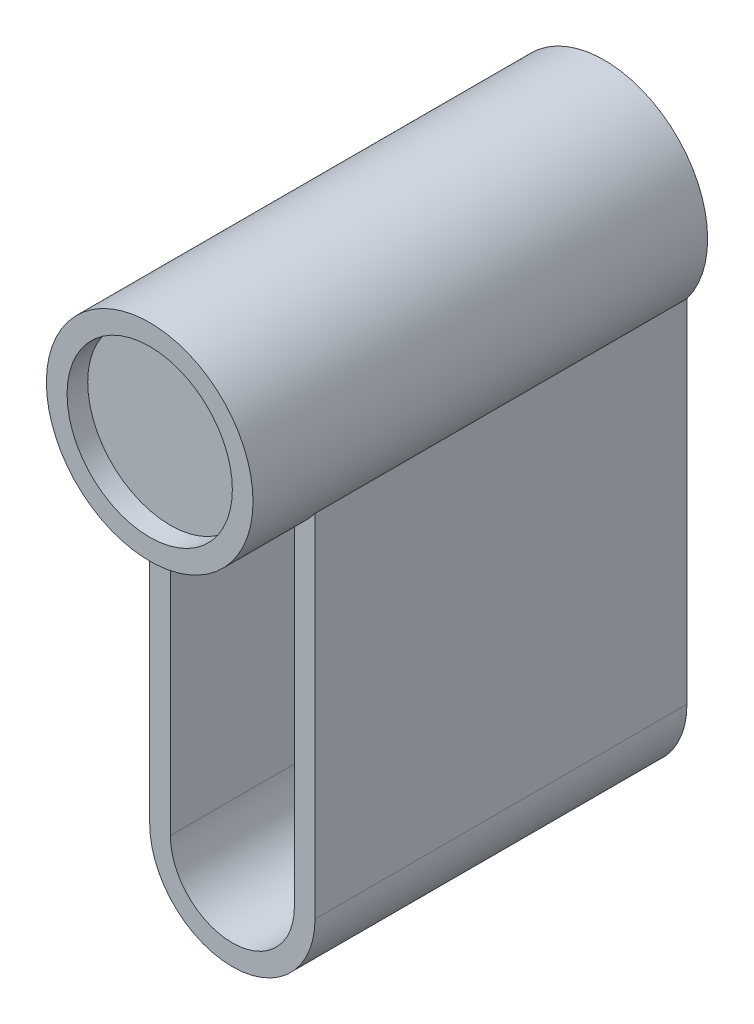
ISO-10303-21;
HEADER;
FILE_DESCRIPTION(('STEP AP214'),'2;1');
FILE_NAME('part.step','',(''),(''),'','','');
FILE_SCHEMA(('AUTOMOTIVE_DESIGN { 1 0 10303 214 1 1 1 1 }'));
ENDSEC;
DATA;
#1=APPLICATION_CONTEXT('core data for automotive mechanical design processes');
#2=APPLICATION_PROTOCOL_DEFINITION('international standard','automotive_design',2000,#1);
#3=PRODUCT_CONTEXT('',#1,'mechanical');
#4=PRODUCT('Part','Part','',(#3));
#5=PRODUCT_RELATED_PRODUCT_CATEGORY('part','',(#4));
#6=PRODUCT_DEFINITION_FORMATION('','',#4);
#7=PRODUCT_DEFINITION_CONTEXT('part definition',#1,'design');
#8=PRODUCT_DEFINITION('design','',#6,#7);
#9=PRODUCT_DEFINITION_SHAPE('','',#8);
#10=(LENGTH_UNIT() NAMED_UNIT(*) SI_UNIT(.MILLI.,.METRE.));
#11=(NAMED_UNIT(*) PLANE_ANGLE_UNIT() SI_UNIT($,.RADIAN.));
#12=(NAMED_UNIT(*) SI_UNIT($,.STERADIAN.) SOLID_ANGLE_UNIT());
#13=UNCERTAINTY_MEASURE_WITH_UNIT(LENGTH_MEASURE(1.E-05),#10,'distance_accuracy_value','');
#14=(GEOMETRIC_REPRESENTATION_CONTEXT(3) GLOBAL_UNCERTAINTY_ASSIGNED_CONTEXT((#13)) GLOBAL_UNIT_ASSIGNED_CONTEXT((#10,
#11,#12)) REPRESENTATION_CONTEXT('',''));
#15=CARTESIAN_POINT('',(0.,0.,0.));
#16=DIRECTION('',(0.,0.,1.));
#17=DIRECTION('',(1.,0.,0.));
#18=AXIS2_PLACEMENT_3D('',#15,#16,#17);
#19=CARTESIAN_POINT('',(0.,0.,110.));
#20=DIRECTION('',(0.,0.,-1.));
#21=DIRECTION('',(-1.,0.,0.));
#22=AXIS2_PLACEMENT_3D('',#19,#20,#21);
#23=CYLINDRICAL_SURFACE('',#22,25.);
#24=CARTESIAN_POINT('',(0.,0.,110.));
#25=DIRECTION('',(0.,0.,1.));
#26=DIRECTION('',(1.,0.,0.));
#27=AXIS2_PLACEMENT_3D('',#24,#25,#26);
#28=CIRCLE('',#27,25.);
#29=CARTESIAN_POINT('',(25.,0.,110.));
#30=VERTEX_POINT('',#29);
#31=EDGE_CURVE('E163',#30,#30,#28,.T.);
#32=ORIENTED_EDGE('',*,*,#31,.F.);
#33=EDGE_LOOP('',(#32));
#34=FACE_BOUND('',#33,.T.);
#35=DIRECTION('',(0.,0.,-1.));
#36=VECTOR('',#35,1.);
#37=CARTESIAN_POINT('',(20.,-15.,110.));
#38=LINE('',#37,#36);
#39=CARTESIAN_POINT('',(20.,-15.,0.));
#40=VERTEX_POINT('',#39);
#41=CARTESIAN_POINT('',(20.,-15.,90.));
#42=VERTEX_POINT('',#41);
#43=EDGE_CURVE('E153',#40,#42,#38,.F.);
#44=ORIENTED_EDGE('',*,*,#43,.F.);
#45=CARTESIAN_POINT('',(0.,0.,0.));
#46=DIRECTION('',(0.,0.,1.));
#47=DIRECTION('',(1.,0.,0.));
#48=AXIS2_PLACEMENT_3D('',#45,#46,#47);
#49=CIRCLE('',#48,25.);
#50=CARTESIAN_POINT('',(-20.,-15.,0.));
#51=VERTEX_POINT('',#50);
#52=EDGE_CURVE('E160',#40,#51,#49,.T.);
#53=ORIENTED_EDGE('',*,*,#52,.T.);
#54=DIRECTION('',(0.,0.,-1.));
#55=VECTOR('',#54,1.);
#56=CARTESIAN_POINT('',(-20.,-15.,110.));
#57=LINE('',#56,#55);
#58=CARTESIAN_POINT('',(-20.,-15.,90.));
#59=VERTEX_POINT('',#58);
#60=EDGE_CURVE('E150',#59,#51,#57,.T.);
#61=ORIENTED_EDGE('',*,*,#60,.F.);
#62=CARTESIAN_POINT('',(0.,0.,90.));
#63=DIRECTION('',(0.,0.,1.));
#64=DIRECTION('',(1.,0.,0.));
#65=AXIS2_PLACEMENT_3D('',#62,#63,#64);
#66=CIRCLE('',#65,25.);
#67=CARTESIAN_POINT('',(-15.,-20.,90.));
#68=VERTEX_POINT('',#67);
#69=EDGE_CURVE('E11',#59,#68,#66,.T.);
#70=ORIENTED_EDGE('',*,*,#69,.T.);
#71=DIRECTION('',(0.,0.,1.));
#72=VECTOR('',#71,1.);
#73=CARTESIAN_POINT('',(-15.,-20.,0.));
#74=LINE('',#73,#72);
#75=CARTESIAN_POINT('',(-15.,-20.,0.));
#76=VERTEX_POINT('',#75);
#77=EDGE_CURVE('E53',#76,#68,#74,.T.);
#78=ORIENTED_EDGE('',*,*,#77,.F.);
#79=CARTESIAN_POINT('',(0.,0.,0.));
#80=DIRECTION('',(0.,0.,-1.));
#81=DIRECTION('',(1.,0.,0.));
#82=AXIS2_PLACEMENT_3D('',#79,#80,#81);
#83=CIRCLE('',#82,25.);
#84=CARTESIAN_POINT('',(15.,-20.,0.));
#85=VERTEX_POINT('',#84);
#86=EDGE_CURVE('E97',#85,#76,#83,.T.);
#87=ORIENTED_EDGE('',*,*,#86,.F.);
#88=DIRECTION('',(0.,0.,1.));
#89=VECTOR('',#88,1.);
#90=CARTESIAN_POINT('',(15.,-20.,0.));
#91=LINE('',#90,#89);
#92=CARTESIAN_POINT('',(15.,-20.,90.));
#93=VERTEX_POINT('',#92);
#94=EDGE_CURVE('E123',#85,#93,#91,.T.);
#95=ORIENTED_EDGE('',*,*,#94,.T.);
#96=EDGE_CURVE('E38',#93,#42,#66,.T.);
#97=ORIENTED_EDGE('',*,*,#96,.T.);
#98=EDGE_LOOP('',(#44,#53,#61,#70,#78,#87,#95,#97));
#99=FACE_BOUND('',#98,.T.);
#100=ADVANCED_FACE('F31',(#34,#99),#23,.T.);
#101=CARTESIAN_POINT('',(0.,0.,110.));
#102=DIRECTION('',(0.,0.,1.));
#103=DIRECTION('',(1.,0.,0.));
#104=AXIS2_PLACEMENT_3D('',#101,#102,#103);
#105=PLANE('',#104);
#106=CARTESIAN_POINT('',(0.,0.,110.));
#107=DIRECTION('',(0.,0.,1.));
#108=DIRECTION('',(1.,0.,0.));
#109=AXIS2_PLACEMENT_3D('',#106,#107,#108);
#110=CIRCLE('',#109,20.);
#111=CARTESIAN_POINT('',(20.,0.,110.));
#112=VERTEX_POINT('',#111);
#113=EDGE_CURVE('E156',#112,#112,#110,.T.);
#114=ORIENTED_EDGE('',*,*,#113,.F.);
#115=EDGE_LOOP('',(#114));
#116=FACE_BOUND('',#115,.T.);
#117=ORIENTED_EDGE('',*,*,#31,.T.);
#118=EDGE_LOOP('',(#117));
#119=FACE_BOUND('',#118,.T.);
#120=ADVANCED_FACE('F196',(#116,#119),#105,.T.);
#121=CARTESIAN_POINT('',(0.,0.,0.));
#122=DIRECTION('',(0.,0.,1.));
#123=DIRECTION('',(1.,0.,0.));
#124=AXIS2_PLACEMENT_3D('',#121,#122,#123);
#125=PLANE('',#124);
#126=DIRECTION('',(0.,1.,0.));
#127=VECTOR('',#126,1.);
#128=CARTESIAN_POINT('',(15.,-100.,0.));
#129=LINE('',#128,#127);
#130=CARTESIAN_POINT('',(15.,-100.,0.));
#131=VERTEX_POINT('',#130);
#132=EDGE_CURVE('E101',#131,#85,#129,.T.);
#133=ORIENTED_EDGE('',*,*,#132,.T.);
#134=ORIENTED_EDGE('',*,*,#86,.T.);
#135=DIRECTION('',(0.,-1.,0.));
#136=VECTOR('',#135,1.);
#137=CARTESIAN_POINT('',(-15.,-20.,0.));
#138=LINE('',#137,#136);
#139=CARTESIAN_POINT('',(-15.,-100.,0.));
#140=VERTEX_POINT('',#139);
#141=EDGE_CURVE('E104',#76,#140,#138,.T.);
#142=ORIENTED_EDGE('',*,*,#141,.T.);
#143=CARTESIAN_POINT('',(0.,-100.,0.));
#144=DIRECTION('',(0.,0.,1.));
#145=DIRECTION('',(1.,0.,0.));
#146=AXIS2_PLACEMENT_3D('',#143,#144,#145);
#147=CIRCLE('',#146,15.);
#148=EDGE_CURVE('E45',#140,#131,#147,.T.);
#149=ORIENTED_EDGE('',*,*,#148,.T.);
#150=EDGE_LOOP('',(#133,#134,#142,#149));
#151=FACE_BOUND('',#150,.T.);
#152=ORIENTED_EDGE('',*,*,#52,.F.);
#153=DIRECTION('',(0.,1.,0.));
#154=VECTOR('',#153,1.);
#155=CARTESIAN_POINT('',(20.,0.,0.));
#156=LINE('',#155,#154);
#157=CARTESIAN_POINT('',(20.,-100.,0.));
#158=VERTEX_POINT('',#157);
#159=EDGE_CURVE('E141',#158,#40,#156,.T.);
#160=ORIENTED_EDGE('',*,*,#159,.F.);
#161=CARTESIAN_POINT('',(0.,-100.,0.));
#162=DIRECTION('',(0.,0.,1.));
#163=DIRECTION('',(1.,0.,0.));
#164=AXIS2_PLACEMENT_3D('',#161,#162,#163);
#165=CIRCLE('',#164,20.);
#166=CARTESIAN_POINT('',(-20.,-100.,0.));
#167=VERTEX_POINT('',#166);
#168=EDGE_CURVE('E125',#167,#158,#165,.T.);
#169=ORIENTED_EDGE('',*,*,#168,.F.);
#170=DIRECTION('',(0.,-1.,0.));
#171=VECTOR('',#170,1.);
#172=CARTESIAN_POINT('',(-20.,-100.,0.));
#173=LINE('',#172,#171);
#174=EDGE_CURVE('E133',#51,#167,#173,.T.);
#175=ORIENTED_EDGE('',*,*,#174,.F.);
#176=EDGE_LOOP('',(#152,#160,#169,#175));
#177=FACE_BOUND('',#176,.T.);
#178=ADVANCED_FACE('F108',(#151,#177),#125,.F.);
#179=CARTESIAN_POINT('',(0.,0.,105.));
#180=DIRECTION('',(0.,0.,1.));
#181=DIRECTION('',(1.,0.,0.));
#182=AXIS2_PLACEMENT_3D('',#179,#180,#181);
#183=CYLINDRICAL_SURFACE('',#182,20.);
#184=CARTESIAN_POINT('',(0.,0.,105.));
#185=DIRECTION('',(0.,0.,1.));
#186=DIRECTION('',(1.,0.,0.));
#187=AXIS2_PLACEMENT_3D('',#184,#185,#186);
#188=CIRCLE('',#187,20.);
#189=CARTESIAN_POINT('',(20.,0.,105.));
#190=VERTEX_POINT('',#189);
#191=EDGE_CURVE('E157',#190,#190,#188,.T.);
#192=ORIENTED_EDGE('',*,*,#191,.F.);
#193=EDGE_LOOP('',(#192));
#194=FACE_BOUND('',#193,.T.);
#195=ORIENTED_EDGE('',*,*,#113,.T.);
#196=EDGE_LOOP('',(#195));
#197=FACE_BOUND('',#196,.T.);
#198=ADVANCED_FACE('F208',(#194,#197),#183,.F.);
#199=CARTESIAN_POINT('',(0.,0.,105.));
#200=DIRECTION('',(0.,0.,1.));
#201=DIRECTION('',(1.,0.,0.));
#202=AXIS2_PLACEMENT_3D('',#199,#200,#201);
#203=PLANE('',#202);
#204=ORIENTED_EDGE('',*,*,#191,.T.);
#205=EDGE_LOOP('',(#204));
#206=FACE_BOUND('',#205,.T.);
#207=ADVANCED_FACE('F192',(#206),#203,.T.);
#208=CARTESIAN_POINT('',(0.,-100.,90.));
#209=DIRECTION('',(0.,0.,1.));
#210=DIRECTION('',(1.,0.,0.));
#211=AXIS2_PLACEMENT_3D('',#208,#209,#210);
#212=PLANE('',#211);
#213=DIRECTION('',(0.,1.,0.));
#214=VECTOR('',#213,1.);
#215=CARTESIAN_POINT('',(15.,-100.,90.));
#216=LINE('',#215,#214);
#217=CARTESIAN_POINT('',(15.,-100.,90.));
#218=VERTEX_POINT('',#217);
#219=EDGE_CURVE('E111',#218,#93,#216,.T.);
#220=ORIENTED_EDGE('',*,*,#219,.F.);
#221=CARTESIAN_POINT('',(0.,-100.,90.));
#222=DIRECTION('',(0.,0.,1.));
#223=DIRECTION('',(1.,0.,0.));
#224=AXIS2_PLACEMENT_3D('',#221,#222,#223);
#225=CIRCLE('',#224,15.);
#226=CARTESIAN_POINT('',(-15.,-100.,90.));
#227=VERTEX_POINT('',#226);
#228=EDGE_CURVE('E114',#227,#218,#225,.T.);
#229=ORIENTED_EDGE('',*,*,#228,.F.);
#230=DIRECTION('',(0.,-1.,0.));
#231=VECTOR('',#230,1.);
#232=CARTESIAN_POINT('',(-15.,-20.,90.));
#233=LINE('',#232,#231);
#234=EDGE_CURVE('E119',#68,#227,#233,.T.);
#235=ORIENTED_EDGE('',*,*,#234,.F.);
#236=ORIENTED_EDGE('',*,*,#69,.F.);
#237=DIRECTION('',(0.,-1.,0.));
#238=VECTOR('',#237,1.);
#239=CARTESIAN_POINT('',(-20.,-100.,90.));
#240=LINE('',#239,#238);
#241=CARTESIAN_POINT('',(-20.,-100.,90.));
#242=VERTEX_POINT('',#241);
#243=EDGE_CURVE('E136',#59,#242,#240,.T.);
#244=ORIENTED_EDGE('',*,*,#243,.T.);
#245=CARTESIAN_POINT('',(0.,-100.,90.));
#246=DIRECTION('',(0.,0.,1.));
#247=DIRECTION('',(1.,0.,0.));
#248=AXIS2_PLACEMENT_3D('',#245,#246,#247);
#249=CIRCLE('',#248,20.);
#250=CARTESIAN_POINT('',(20.,-100.,90.));
#251=VERTEX_POINT('',#250);
#252=EDGE_CURVE('E129',#242,#251,#249,.T.);
#253=ORIENTED_EDGE('',*,*,#252,.T.);
#254=DIRECTION('',(0.,1.,0.));
#255=VECTOR('',#254,1.);
#256=CARTESIAN_POINT('',(20.,0.,90.));
#257=LINE('',#256,#255);
#258=EDGE_CURVE('E132',#251,#42,#257,.T.);
#259=ORIENTED_EDGE('',*,*,#258,.T.);
#260=ORIENTED_EDGE('',*,*,#96,.F.);
#261=EDGE_LOOP('',(#220,#229,#235,#236,#244,#253,#259,#260));
#262=FACE_BOUND('',#261,.T.);
#263=ADVANCED_FACE('F177',(#262),#212,.T.);
#264=CARTESIAN_POINT('',(20.,0.,90.));
#265=DIRECTION('',(-1.,0.,0.));
#266=DIRECTION('',(0.,0.,1.));
#267=AXIS2_PLACEMENT_3D('',#264,#265,#266);
#268=PLANE('',#267);
#269=ORIENTED_EDGE('',*,*,#159,.T.);
#270=ORIENTED_EDGE('',*,*,#43,.T.);
#271=ORIENTED_EDGE('',*,*,#258,.F.);
#272=DIRECTION('',(0.,0.,-1.));
#273=VECTOR('',#272,1.);
#274=CARTESIAN_POINT('',(20.,-100.,90.));
#275=LINE('',#274,#273);
#276=EDGE_CURVE('E147',#251,#158,#275,.T.);
#277=ORIENTED_EDGE('',*,*,#276,.T.);
#278=EDGE_LOOP('',(#269,#270,#271,#277));
#279=FACE_BOUND('',#278,.T.);
#280=ADVANCED_FACE('F184',(#279),#268,.F.);
#281=CARTESIAN_POINT('',(-20.,-100.,90.));
#282=DIRECTION('',(1.,0.,0.));
#283=DIRECTION('',(0.,0.,-1.));
#284=AXIS2_PLACEMENT_3D('',#281,#282,#283);
#285=PLANE('',#284);
#286=ORIENTED_EDGE('',*,*,#243,.F.);
#287=ORIENTED_EDGE('',*,*,#60,.T.);
#288=ORIENTED_EDGE('',*,*,#174,.T.);
#289=DIRECTION('',(0.,0.,-1.));
#290=VECTOR('',#289,1.);
#291=CARTESIAN_POINT('',(-20.,-100.,90.));
#292=LINE('',#291,#290);
#293=EDGE_CURVE('E138',#242,#167,#292,.T.);
#294=ORIENTED_EDGE('',*,*,#293,.F.);
#295=EDGE_LOOP('',(#286,#287,#288,#294));
#296=FACE_BOUND('',#295,.T.);
#297=ADVANCED_FACE('F168',(#296),#285,.F.);
#298=CARTESIAN_POINT('',(0.,-100.,90.));
#299=DIRECTION('',(0.,0.,-1.));
#300=DIRECTION('',(-1.,0.,0.));
#301=AXIS2_PLACEMENT_3D('',#298,#299,#300);
#302=CYLINDRICAL_SURFACE('',#301,20.);
#303=ORIENTED_EDGE('',*,*,#168,.T.);
#304=ORIENTED_EDGE('',*,*,#276,.F.);
#305=ORIENTED_EDGE('',*,*,#252,.F.);
#306=ORIENTED_EDGE('',*,*,#293,.T.);
#307=EDGE_LOOP('',(#303,#304,#305,#306));
#308=FACE_BOUND('',#307,.T.);
#309=ADVANCED_FACE('F173',(#308),#302,.T.);
#310=CARTESIAN_POINT('',(15.,-100.,0.));
#311=DIRECTION('',(1.,0.,0.));
#312=DIRECTION('',(0.,0.,-1.));
#313=AXIS2_PLACEMENT_3D('',#310,#311,#312);
#314=PLANE('',#313);
#315=ORIENTED_EDGE('',*,*,#219,.T.);
#316=ORIENTED_EDGE('',*,*,#94,.F.);
#317=ORIENTED_EDGE('',*,*,#132,.F.);
#318=DIRECTION('',(0.,0.,1.));
#319=VECTOR('',#318,1.);
#320=CARTESIAN_POINT('',(15.,-100.,0.));
#321=LINE('',#320,#319);
#322=EDGE_CURVE('E126',#131,#218,#321,.T.);
#323=ORIENTED_EDGE('',*,*,#322,.T.);
#324=EDGE_LOOP('',(#315,#316,#317,#323));
#325=FACE_BOUND('',#324,.T.);
#326=ADVANCED_FACE('F182',(#325),#314,.F.);
#327=CARTESIAN_POINT('',(0.,-100.,0.));
#328=DIRECTION('',(0.,0.,1.));
#329=DIRECTION('',(1.,0.,0.));
#330=AXIS2_PLACEMENT_3D('',#327,#328,#329);
#331=CYLINDRICAL_SURFACE('',#330,15.);
#332=ORIENTED_EDGE('',*,*,#228,.T.);
#333=ORIENTED_EDGE('',*,*,#322,.F.);
#334=ORIENTED_EDGE('',*,*,#148,.F.);
#335=DIRECTION('',(0.,0.,1.));
#336=VECTOR('',#335,1.);
#337=CARTESIAN_POINT('',(-15.,-100.,0.));
#338=LINE('',#337,#336);
#339=EDGE_CURVE('E100',#140,#227,#338,.T.);
#340=ORIENTED_EDGE('',*,*,#339,.T.);
#341=EDGE_LOOP('',(#332,#333,#334,#340));
#342=FACE_BOUND('',#341,.T.);
#343=ADVANCED_FACE('F180',(#342),#331,.F.);
#344=CARTESIAN_POINT('',(-15.,-20.,0.));
#345=DIRECTION('',(-1.,0.,0.));
#346=DIRECTION('',(0.,0.,1.));
#347=AXIS2_PLACEMENT_3D('',#344,#345,#346);
#348=PLANE('',#347);
#349=ORIENTED_EDGE('',*,*,#234,.T.);
#350=ORIENTED_EDGE('',*,*,#339,.F.);
#351=ORIENTED_EDGE('',*,*,#141,.F.);
#352=ORIENTED_EDGE('',*,*,#77,.T.);
#353=EDGE_LOOP('',(#349,#350,#351,#352));
#354=FACE_BOUND('',#353,.T.);
#355=ADVANCED_FACE('F105',(#354),#348,.F.);
#356=CLOSED_SHELL('',(#100,#120,#178,#198,#207,#263,#280,#297,#309,#326,#343,#355));
#357=MANIFOLD_SOLID_BREP('B2',#356);
#358=ADVANCED_BREP_SHAPE_REPRESENTATION('',(#18,#357),#14);
#359=SHAPE_DEFINITION_REPRESENTATION(#9,#358);
ENDSEC;
END-ISO-10303-21;
